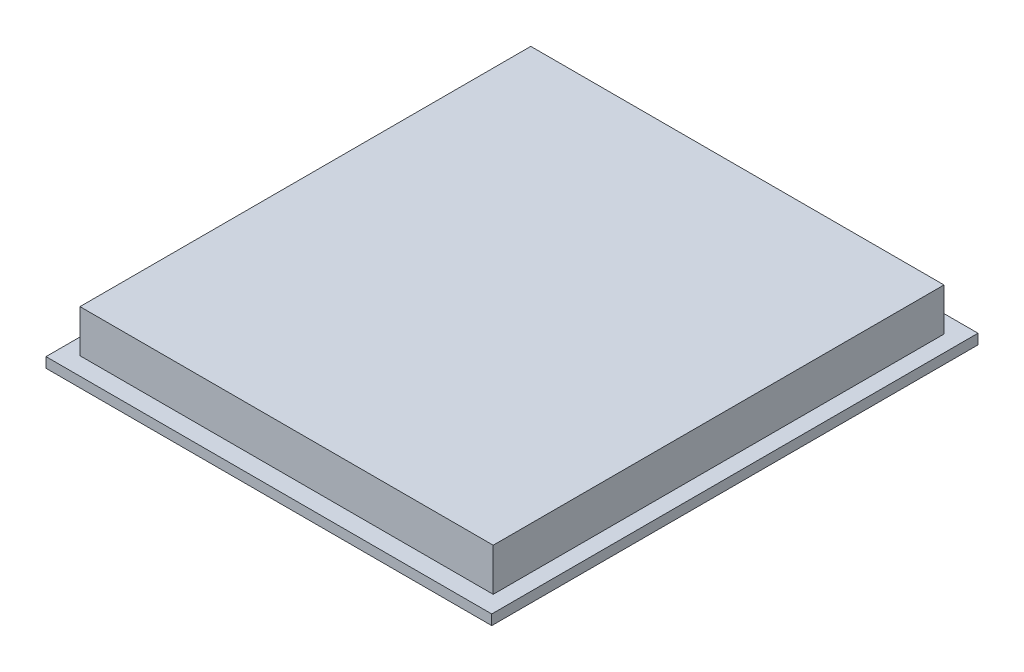
ISO-10303-21;
HEADER;
FILE_DESCRIPTION(('STEP AP214'),'2;1');
FILE_NAME('part.step','',(''),(''),'','','');
FILE_SCHEMA(('AUTOMOTIVE_DESIGN { 1 0 10303 214 1 1 1 1 }'));
ENDSEC;
DATA;
#1=APPLICATION_CONTEXT('core data for automotive mechanical design processes');
#2=APPLICATION_PROTOCOL_DEFINITION('international standard','automotive_design',2000,#1);
#3=PRODUCT_CONTEXT('',#1,'mechanical');
#4=PRODUCT('Part','Part','',(#3));
#5=PRODUCT_RELATED_PRODUCT_CATEGORY('part','',(#4));
#6=PRODUCT_DEFINITION_FORMATION('','',#4);
#7=PRODUCT_DEFINITION_CONTEXT('part definition',#1,'design');
#8=PRODUCT_DEFINITION('design','',#6,#7);
#9=PRODUCT_DEFINITION_SHAPE('','',#8);
#10=(LENGTH_UNIT() NAMED_UNIT(*) SI_UNIT(.MILLI.,.METRE.));
#11=(NAMED_UNIT(*) PLANE_ANGLE_UNIT() SI_UNIT($,.RADIAN.));
#12=(NAMED_UNIT(*) SI_UNIT($,.STERADIAN.) SOLID_ANGLE_UNIT());
#13=UNCERTAINTY_MEASURE_WITH_UNIT(LENGTH_MEASURE(1.E-05),#10,'distance_accuracy_value','');
#14=(GEOMETRIC_REPRESENTATION_CONTEXT(3) GLOBAL_UNCERTAINTY_ASSIGNED_CONTEXT((#13)) GLOBAL_UNIT_ASSIGNED_CONTEXT((#10,
#11,#12)) REPRESENTATION_CONTEXT('',''));
#15=CARTESIAN_POINT('',(0.,0.,0.));
#16=DIRECTION('',(0.,0.,1.));
#17=DIRECTION('',(1.,0.,0.));
#18=AXIS2_PLACEMENT_3D('',#15,#16,#17);
#19=CARTESIAN_POINT('',(0.,1.3,0.));
#20=DIRECTION('',(0.,1.,0.));
#21=DIRECTION('',(0.,0.,1.));
#22=AXIS2_PLACEMENT_3D('',#19,#20,#21);
#23=PLANE('',#22);
#24=DIRECTION('',(0.,0.,1.));
#25=VECTOR('',#24,1.);
#26=CARTESIAN_POINT('',(5.09895833333333,1.3,-5.5625));
#27=LINE('',#26,#25);
#28=CARTESIAN_POINT('',(5.09895833333334,1.3,5.5625));
#29=VERTEX_POINT('',#28);
#30=CARTESIAN_POINT('',(5.09895833333333,1.3,-5.5625));
#31=VERTEX_POINT('',#30);
#32=EDGE_CURVE('E103',#29,#31,#27,.F.);
#33=ORIENTED_EDGE('',*,*,#32,.T.);
#34=DIRECTION('',(1.,0.,0.));
#35=VECTOR('',#34,1.);
#36=CARTESIAN_POINT('',(-5.09895833333333,1.3,-5.5625));
#37=LINE('',#36,#35);
#38=CARTESIAN_POINT('',(-5.09895833333333,1.3,-5.5625));
#39=VERTEX_POINT('',#38);
#40=EDGE_CURVE('E95',#31,#39,#37,.F.);
#41=ORIENTED_EDGE('',*,*,#40,.T.);
#42=DIRECTION('',(0.,0.,-1.));
#43=VECTOR('',#42,1.);
#44=CARTESIAN_POINT('',(-5.09895833333333,1.3,-5.5625));
#45=LINE('',#44,#43);
#46=CARTESIAN_POINT('',(-5.09895833333333,1.3,5.5625));
#47=VERTEX_POINT('',#46);
#48=EDGE_CURVE('E79',#39,#47,#45,.F.);
#49=ORIENTED_EDGE('',*,*,#48,.T.);
#50=DIRECTION('',(-1.,0.,0.));
#51=VECTOR('',#50,1.);
#52=CARTESIAN_POINT('',(-5.09895833333333,1.3,5.5625));
#53=LINE('',#52,#51);
#54=EDGE_CURVE('E19',#47,#29,#53,.F.);
#55=ORIENTED_EDGE('',*,*,#54,.T.);
#56=EDGE_LOOP('',(#33,#41,#49,#55));
#57=FACE_BOUND('',#56,.T.);
#58=ADVANCED_FACE('F16',(#57),#23,.T.);
#59=CARTESIAN_POINT('',(-5.09895833333333,1.3,5.5625));
#60=DIRECTION('',(0.,0.,-1.));
#61=DIRECTION('',(-1.,0.,0.));
#62=AXIS2_PLACEMENT_3D('',#59,#60,#61);
#63=PLANE('',#62);
#64=DIRECTION('',(0.,1.,0.));
#65=VECTOR('',#64,1.);
#66=CARTESIAN_POINT('',(5.09895833333334,1.3,5.5625));
#67=LINE('',#66,#65);
#68=CARTESIAN_POINT('',(5.09895833333334,0.25,5.5625));
#69=VERTEX_POINT('',#68);
#70=EDGE_CURVE('E89',#69,#29,#67,.T.);
#71=ORIENTED_EDGE('',*,*,#70,.T.);
#72=ORIENTED_EDGE('',*,*,#54,.F.);
#73=DIRECTION('',(0.,1.,0.));
#74=VECTOR('',#73,1.);
#75=CARTESIAN_POINT('',(-5.09895833333333,1.3,5.5625));
#76=LINE('',#75,#74);
#77=CARTESIAN_POINT('',(-5.09895833333333,0.25,5.5625));
#78=VERTEX_POINT('',#77);
#79=EDGE_CURVE('E87',#47,#78,#76,.F.);
#80=ORIENTED_EDGE('',*,*,#79,.T.);
#81=DIRECTION('',(1.,0.,0.));
#82=VECTOR('',#81,1.);
#83=CARTESIAN_POINT('',(0.,0.25,5.5625));
#84=LINE('',#83,#82);
#85=EDGE_CURVE('E108',#69,#78,#84,.F.);
#86=ORIENTED_EDGE('',*,*,#85,.F.);
#87=EDGE_LOOP('',(#71,#72,#80,#86));
#88=FACE_BOUND('',#87,.T.);
#89=ADVANCED_FACE('F85',(#88),#63,.F.);
#90=CARTESIAN_POINT('',(-5.09895833333333,1.3,-5.5625));
#91=DIRECTION('',(1.,0.,0.));
#92=DIRECTION('',(0.,0.,-1.));
#93=AXIS2_PLACEMENT_3D('',#90,#91,#92);
#94=PLANE('',#93);
#95=ORIENTED_EDGE('',*,*,#79,.F.);
#96=ORIENTED_EDGE('',*,*,#48,.F.);
#97=DIRECTION('',(0.,1.,0.));
#98=VECTOR('',#97,1.);
#99=CARTESIAN_POINT('',(-5.09895833333333,1.3,-5.5625));
#100=LINE('',#99,#98);
#101=CARTESIAN_POINT('',(-5.09895833333333,0.25,-5.5625));
#102=VERTEX_POINT('',#101);
#103=EDGE_CURVE('E100',#39,#102,#100,.F.);
#104=ORIENTED_EDGE('',*,*,#103,.T.);
#105=DIRECTION('',(0.,0.,1.));
#106=VECTOR('',#105,1.);
#107=CARTESIAN_POINT('',(-5.09895833333333,0.25,0.));
#108=LINE('',#107,#106);
#109=EDGE_CURVE('E94',#78,#102,#108,.F.);
#110=ORIENTED_EDGE('',*,*,#109,.F.);
#111=EDGE_LOOP('',(#95,#96,#104,#110));
#112=FACE_BOUND('',#111,.T.);
#113=ADVANCED_FACE('F93',(#112),#94,.F.);
#114=CARTESIAN_POINT('',(-5.09895833333333,1.3,-5.5625));
#115=DIRECTION('',(0.,0.,1.));
#116=DIRECTION('',(1.,0.,0.));
#117=AXIS2_PLACEMENT_3D('',#114,#115,#116);
#118=PLANE('',#117);
#119=ORIENTED_EDGE('',*,*,#103,.F.);
#120=ORIENTED_EDGE('',*,*,#40,.F.);
#121=DIRECTION('',(0.,1.,0.));
#122=VECTOR('',#121,1.);
#123=CARTESIAN_POINT('',(5.09895833333333,1.3,-5.5625));
#124=LINE('',#123,#122);
#125=CARTESIAN_POINT('',(5.09895833333333,0.25,-5.5625));
#126=VERTEX_POINT('',#125);
#127=EDGE_CURVE('E105',#31,#126,#124,.F.);
#128=ORIENTED_EDGE('',*,*,#127,.T.);
#129=DIRECTION('',(1.,0.,0.));
#130=VECTOR('',#129,1.);
#131=CARTESIAN_POINT('',(0.,0.25,-5.5625));
#132=LINE('',#131,#130);
#133=EDGE_CURVE('E111',#102,#126,#132,.T.);
#134=ORIENTED_EDGE('',*,*,#133,.F.);
#135=EDGE_LOOP('',(#119,#120,#128,#134));
#136=FACE_BOUND('',#135,.T.);
#137=ADVANCED_FACE('F177',(#136),#118,.F.);
#138=CARTESIAN_POINT('',(5.09895833333333,1.3,-5.5625));
#139=DIRECTION('',(-1.,0.,0.));
#140=DIRECTION('',(0.,0.,1.));
#141=AXIS2_PLACEMENT_3D('',#138,#139,#140);
#142=PLANE('',#141);
#143=ORIENTED_EDGE('',*,*,#127,.F.);
#144=ORIENTED_EDGE('',*,*,#32,.F.);
#145=ORIENTED_EDGE('',*,*,#70,.F.);
#146=DIRECTION('',(0.,0.,1.));
#147=VECTOR('',#146,1.);
#148=CARTESIAN_POINT('',(5.09895833333333,0.25,0.));
#149=LINE('',#148,#147);
#150=EDGE_CURVE('E113',#126,#69,#149,.T.);
#151=ORIENTED_EDGE('',*,*,#150,.F.);
#152=EDGE_LOOP('',(#143,#144,#145,#151));
#153=FACE_BOUND('',#152,.T.);
#154=ADVANCED_FACE('F173',(#153),#142,.F.);
#155=CARTESIAN_POINT('',(0.,0.25,0.));
#156=DIRECTION('',(0.,1.,0.));
#157=DIRECTION('',(0.,0.,1.));
#158=AXIS2_PLACEMENT_3D('',#155,#156,#157);
#159=PLANE('',#158);
#160=ORIENTED_EDGE('',*,*,#133,.T.);
#161=ORIENTED_EDGE('',*,*,#150,.T.);
#162=ORIENTED_EDGE('',*,*,#85,.T.);
#163=ORIENTED_EDGE('',*,*,#109,.T.);
#164=EDGE_LOOP('',(#160,#161,#162,#163));
#165=FACE_BOUND('',#164,.T.);
#166=DIRECTION('',(0.,0.,-1.));
#167=VECTOR('',#166,1.);
#168=CARTESIAN_POINT('',(5.5,0.25,-6.));
#169=LINE('',#168,#167);
#170=CARTESIAN_POINT('',(5.5,0.25,-6.));
#171=VERTEX_POINT('',#170);
#172=CARTESIAN_POINT('',(5.5,0.25,6.));
#173=VERTEX_POINT('',#172);
#174=EDGE_CURVE('E119',#171,#173,#169,.F.);
#175=ORIENTED_EDGE('',*,*,#174,.F.);
#176=DIRECTION('',(-1.,0.,0.));
#177=VECTOR('',#176,1.);
#178=CARTESIAN_POINT('',(-5.5,0.25,-6.));
#179=LINE('',#178,#177);
#180=CARTESIAN_POINT('',(-5.5,0.25,-6.));
#181=VERTEX_POINT('',#180);
#182=EDGE_CURVE('E123',#181,#171,#179,.F.);
#183=ORIENTED_EDGE('',*,*,#182,.F.);
#184=DIRECTION('',(0.,0.,-1.));
#185=VECTOR('',#184,1.);
#186=CARTESIAN_POINT('',(-5.5,0.25,-6.));
#187=LINE('',#186,#185);
#188=CARTESIAN_POINT('',(-5.5,0.25,6.));
#189=VERTEX_POINT('',#188);
#190=EDGE_CURVE('E128',#181,#189,#187,.F.);
#191=ORIENTED_EDGE('',*,*,#190,.T.);
#192=DIRECTION('',(-1.,0.,0.));
#193=VECTOR('',#192,1.);
#194=CARTESIAN_POINT('',(-5.5,0.25,6.));
#195=LINE('',#194,#193);
#196=EDGE_CURVE('E116',#189,#173,#195,.F.);
#197=ORIENTED_EDGE('',*,*,#196,.T.);
#198=EDGE_LOOP('',(#175,#183,#191,#197));
#199=FACE_BOUND('',#198,.T.);
#200=ADVANCED_FACE('F170',(#165,#199),#159,.T.);
#201=CARTESIAN_POINT('',(-5.5,0.25,6.));
#202=DIRECTION('',(0.,0.,-1.));
#203=DIRECTION('',(-1.,0.,0.));
#204=AXIS2_PLACEMENT_3D('',#201,#202,#203);
#205=PLANE('',#204);
#206=DIRECTION('',(0.,1.,0.));
#207=VECTOR('',#206,1.);
#208=CARTESIAN_POINT('',(5.5,0.25,6.));
#209=LINE('',#208,#207);
#210=CARTESIAN_POINT('',(5.5,0.,6.));
#211=VERTEX_POINT('',#210);
#212=EDGE_CURVE('E121',#173,#211,#209,.F.);
#213=ORIENTED_EDGE('',*,*,#212,.F.);
#214=ORIENTED_EDGE('',*,*,#196,.F.);
#215=DIRECTION('',(0.,1.,0.));
#216=VECTOR('',#215,1.);
#217=CARTESIAN_POINT('',(-5.5,0.25,6.));
#218=LINE('',#217,#216);
#219=CARTESIAN_POINT('',(-5.5,0.,6.));
#220=VERTEX_POINT('',#219);
#221=EDGE_CURVE('E131',#189,#220,#218,.F.);
#222=ORIENTED_EDGE('',*,*,#221,.T.);
#223=DIRECTION('',(1.,0.,0.));
#224=VECTOR('',#223,1.);
#225=CARTESIAN_POINT('',(0.,0.,6.));
#226=LINE('',#225,#224);
#227=EDGE_CURVE('E134',#220,#211,#226,.T.);
#228=ORIENTED_EDGE('',*,*,#227,.T.);
#229=EDGE_LOOP('',(#213,#214,#222,#228));
#230=FACE_BOUND('',#229,.T.);
#231=ADVANCED_FACE('F153',(#230),#205,.F.);
#232=CARTESIAN_POINT('',(5.5,0.25,-6.));
#233=DIRECTION('',(1.,0.,0.));
#234=DIRECTION('',(0.,0.,-1.));
#235=AXIS2_PLACEMENT_3D('',#232,#233,#234);
#236=PLANE('',#235);
#237=ORIENTED_EDGE('',*,*,#174,.T.);
#238=ORIENTED_EDGE('',*,*,#212,.T.);
#239=DIRECTION('',(0.,0.,1.));
#240=VECTOR('',#239,1.);
#241=CARTESIAN_POINT('',(5.5,0.,0.));
#242=LINE('',#241,#240);
#243=CARTESIAN_POINT('',(5.5,0.,-6.));
#244=VERTEX_POINT('',#243);
#245=EDGE_CURVE('E137',#211,#244,#242,.F.);
#246=ORIENTED_EDGE('',*,*,#245,.T.);
#247=DIRECTION('',(0.,1.,0.));
#248=VECTOR('',#247,1.);
#249=CARTESIAN_POINT('',(5.5,0.25,-6.));
#250=LINE('',#249,#248);
#251=EDGE_CURVE('E125',#171,#244,#250,.F.);
#252=ORIENTED_EDGE('',*,*,#251,.F.);
#253=EDGE_LOOP('',(#237,#238,#246,#252));
#254=FACE_BOUND('',#253,.T.);
#255=ADVANCED_FACE('F149',(#254),#236,.T.);
#256=CARTESIAN_POINT('',(-5.5,0.25,-6.));
#257=DIRECTION('',(0.,0.,-1.));
#258=DIRECTION('',(-1.,0.,0.));
#259=AXIS2_PLACEMENT_3D('',#256,#257,#258);
#260=PLANE('',#259);
#261=ORIENTED_EDGE('',*,*,#182,.T.);
#262=ORIENTED_EDGE('',*,*,#251,.T.);
#263=DIRECTION('',(1.,0.,0.));
#264=VECTOR('',#263,1.);
#265=CARTESIAN_POINT('',(0.,0.,-6.));
#266=LINE('',#265,#264);
#267=CARTESIAN_POINT('',(-5.5,0.,-6.));
#268=VERTEX_POINT('',#267);
#269=EDGE_CURVE('E25',#244,#268,#266,.F.);
#270=ORIENTED_EDGE('',*,*,#269,.T.);
#271=DIRECTION('',(0.,1.,0.));
#272=VECTOR('',#271,1.);
#273=CARTESIAN_POINT('',(-5.5,0.25,-6.));
#274=LINE('',#273,#272);
#275=EDGE_CURVE('E33',#268,#181,#274,.T.);
#276=ORIENTED_EDGE('',*,*,#275,.T.);
#277=EDGE_LOOP('',(#261,#262,#270,#276));
#278=FACE_BOUND('',#277,.T.);
#279=ADVANCED_FACE('F143',(#278),#260,.T.);
#280=CARTESIAN_POINT('',(-5.5,0.25,-6.));
#281=DIRECTION('',(1.,0.,0.));
#282=DIRECTION('',(0.,0.,-1.));
#283=AXIS2_PLACEMENT_3D('',#280,#281,#282);
#284=PLANE('',#283);
#285=ORIENTED_EDGE('',*,*,#221,.F.);
#286=ORIENTED_EDGE('',*,*,#190,.F.);
#287=ORIENTED_EDGE('',*,*,#275,.F.);
#288=DIRECTION('',(0.,0.,1.));
#289=VECTOR('',#288,1.);
#290=CARTESIAN_POINT('',(-5.5,0.,0.));
#291=LINE('',#290,#289);
#292=EDGE_CURVE('E11',#268,#220,#291,.T.);
#293=ORIENTED_EDGE('',*,*,#292,.T.);
#294=EDGE_LOOP('',(#285,#286,#287,#293));
#295=FACE_BOUND('',#294,.T.);
#296=ADVANCED_FACE('F155',(#295),#284,.F.);
#297=CARTESIAN_POINT('',(0.,0.,0.));
#298=DIRECTION('',(0.,1.,0.));
#299=DIRECTION('',(0.,0.,1.));
#300=AXIS2_PLACEMENT_3D('',#297,#298,#299);
#301=PLANE('',#300);
#302=ORIENTED_EDGE('',*,*,#269,.F.);
#303=ORIENTED_EDGE('',*,*,#245,.F.);
#304=ORIENTED_EDGE('',*,*,#227,.F.);
#305=ORIENTED_EDGE('',*,*,#292,.F.);
#306=EDGE_LOOP('',(#302,#303,#304,#305));
#307=FACE_BOUND('',#306,.T.);
#308=ADVANCED_FACE('F147',(#307),#301,.F.);
#309=CLOSED_SHELL('',(#58,#89,#113,#137,#154,#200,#231,#255,#279,#296,#308));
#310=MANIFOLD_SOLID_BREP('B1',#309);
#311=ADVANCED_BREP_SHAPE_REPRESENTATION('',(#18,#310),#14);
#312=SHAPE_DEFINITION_REPRESENTATION(#9,#311);
ENDSEC;
END-ISO-10303-21;
